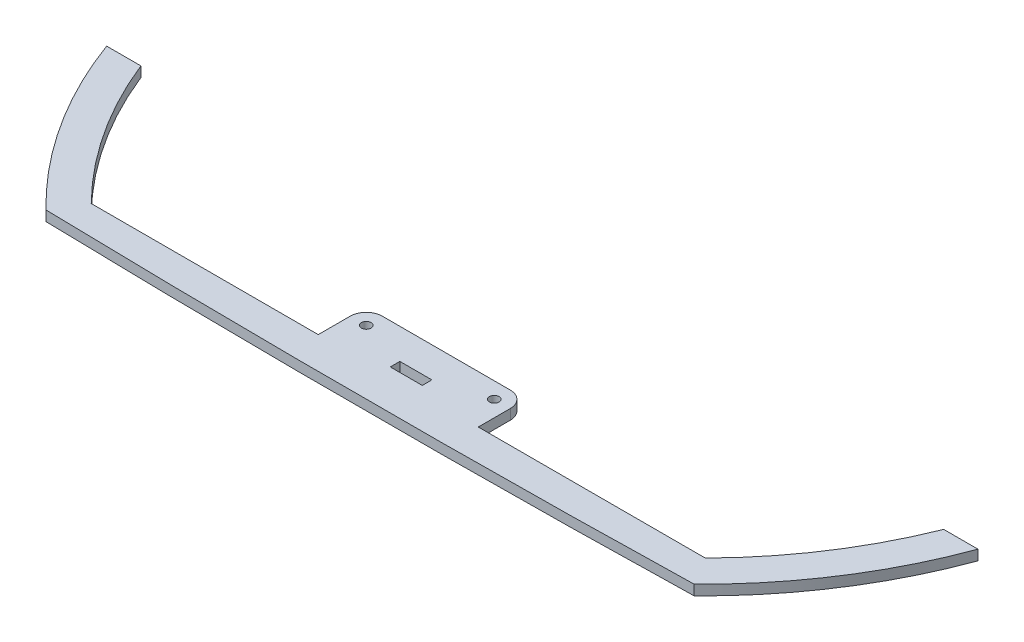
ISO-10303-21;
HEADER;
FILE_DESCRIPTION(('STEP AP214'),'2;1');
FILE_NAME('part.step','',(''),(''),'','','');
FILE_SCHEMA(('AUTOMOTIVE_DESIGN { 1 0 10303 214 1 1 1 1 }'));
ENDSEC;
DATA;
#1=APPLICATION_CONTEXT('core data for automotive mechanical design processes');
#2=APPLICATION_PROTOCOL_DEFINITION('international standard','automotive_design',2000,#1);
#3=PRODUCT_CONTEXT('',#1,'mechanical');
#4=PRODUCT('Part','Part','',(#3));
#5=PRODUCT_RELATED_PRODUCT_CATEGORY('part','',(#4));
#6=PRODUCT_DEFINITION_FORMATION('','',#4);
#7=PRODUCT_DEFINITION_CONTEXT('part definition',#1,'design');
#8=PRODUCT_DEFINITION('design','',#6,#7);
#9=PRODUCT_DEFINITION_SHAPE('','',#8);
#10=(LENGTH_UNIT() NAMED_UNIT(*) SI_UNIT(.MILLI.,.METRE.));
#11=(NAMED_UNIT(*) PLANE_ANGLE_UNIT() SI_UNIT($,.RADIAN.));
#12=(NAMED_UNIT(*) SI_UNIT($,.STERADIAN.) SOLID_ANGLE_UNIT());
#13=UNCERTAINTY_MEASURE_WITH_UNIT(LENGTH_MEASURE(1.E-05),#10,'distance_accuracy_value','');
#14=(GEOMETRIC_REPRESENTATION_CONTEXT(3) GLOBAL_UNCERTAINTY_ASSIGNED_CONTEXT((#13)) GLOBAL_UNIT_ASSIGNED_CONTEXT((#10,
#11,#12)) REPRESENTATION_CONTEXT('',''));
#15=CARTESIAN_POINT('',(0.,0.,0.));
#16=DIRECTION('',(0.,0.,1.));
#17=DIRECTION('',(1.,0.,0.));
#18=AXIS2_PLACEMENT_3D('',#15,#16,#17);
#19=CARTESIAN_POINT('',(0.,3.175,10.));
#20=DIRECTION('',(0.,1.,0.));
#21=DIRECTION('',(0.,0.,1.));
#22=AXIS2_PLACEMENT_3D('',#19,#20,#21);
#23=PLANE('',#22);
#24=CARTESIAN_POINT('',(-20.,3.175,0.));
#25=DIRECTION('',(0.,1.,0.));
#26=DIRECTION('',(0.,0.,1.));
#27=AXIS2_PLACEMENT_3D('',#24,#25,#26);
#28=CIRCLE('',#27,1.5);
#29=CARTESIAN_POINT('',(-20.,3.175,1.5));
#30=VERTEX_POINT('',#29);
#31=EDGE_CURVE('E227',#30,#30,#28,.T.);
#32=ORIENTED_EDGE('',*,*,#31,.F.);
#33=EDGE_LOOP('',(#32));
#34=FACE_BOUND('',#33,.T.);
#35=DIRECTION('',(-1.,0.,0.));
#36=VECTOR('',#35,1.);
#37=CARTESIAN_POINT('',(25.,3.175,10.));
#38=LINE('',#37,#36);
#39=CARTESIAN_POINT('',(95.9166304662544,3.175,9.99999999999999));
#40=VERTEX_POINT('',#39);
#41=CARTESIAN_POINT('',(25.,3.175,10.));
#42=VERTEX_POINT('',#41);
#43=EDGE_CURVE('E235',#40,#42,#38,.T.);
#44=ORIENTED_EDGE('',*,*,#43,.T.);
#45=DIRECTION('',(0.,0.,-1.));
#46=VECTOR('',#45,1.);
#47=CARTESIAN_POINT('',(25.,3.175,0.));
#48=LINE('',#47,#46);
#49=CARTESIAN_POINT('',(25.,3.175,0.));
#50=VERTEX_POINT('',#49);
#51=EDGE_CURVE('E239',#42,#50,#48,.T.);
#52=ORIENTED_EDGE('',*,*,#51,.T.);
#53=CARTESIAN_POINT('',(20.,3.175,0.));
#54=DIRECTION('',(0.,1.,0.));
#55=DIRECTION('',(0.,0.,-1.));
#56=AXIS2_PLACEMENT_3D('',#53,#54,#55);
#57=CIRCLE('',#56,5.);
#58=CARTESIAN_POINT('',(20.,3.175,-5.));
#59=VERTEX_POINT('',#58);
#60=EDGE_CURVE('E243',#50,#59,#57,.T.);
#61=ORIENTED_EDGE('',*,*,#60,.T.);
#62=DIRECTION('',(-1.,0.,0.));
#63=VECTOR('',#62,1.);
#64=CARTESIAN_POINT('',(-20.,3.175,-5.));
#65=LINE('',#64,#63);
#66=CARTESIAN_POINT('',(-20.,3.175,-5.));
#67=VERTEX_POINT('',#66);
#68=EDGE_CURVE('E246',#59,#67,#65,.T.);
#69=ORIENTED_EDGE('',*,*,#68,.T.);
#70=CARTESIAN_POINT('',(-20.,3.175,0.));
#71=DIRECTION('',(0.,1.,0.));
#72=DIRECTION('',(0.,0.,1.));
#73=AXIS2_PLACEMENT_3D('',#70,#71,#72);
#74=CIRCLE('',#73,5.);
#75=CARTESIAN_POINT('',(-25.,3.175,0.));
#76=VERTEX_POINT('',#75);
#77=EDGE_CURVE('E249',#67,#76,#74,.T.);
#78=ORIENTED_EDGE('',*,*,#77,.T.);
#79=DIRECTION('',(0.,0.,1.));
#80=VECTOR('',#79,1.);
#81=CARTESIAN_POINT('',(-25.,3.175,0.));
#82=LINE('',#81,#80);
#83=CARTESIAN_POINT('',(-25.,3.175,10.));
#84=VERTEX_POINT('',#83);
#85=EDGE_CURVE('E252',#76,#84,#82,.T.);
#86=ORIENTED_EDGE('',*,*,#85,.T.);
#87=DIRECTION('',(-1.,0.,0.));
#88=VECTOR('',#87,1.);
#89=CARTESIAN_POINT('',(-25.,3.175,10.));
#90=LINE('',#89,#88);
#91=CARTESIAN_POINT('',(-95.9166304662544,3.175,10.));
#92=VERTEX_POINT('',#91);
#93=EDGE_CURVE('E255',#84,#92,#90,.T.);
#94=ORIENTED_EDGE('',*,*,#93,.T.);
#95=CARTESIAN_POINT('',(0.,3.175,-85.));
#96=DIRECTION('',(0.,-1.,0.));
#97=DIRECTION('',(0.,0.,1.));
#98=AXIS2_PLACEMENT_3D('',#95,#96,#97);
#99=CIRCLE('',#98,135.);
#100=CARTESIAN_POINT('',(-125.399362039845,3.175,-35.0000000000001));
#101=VERTEX_POINT('',#100);
#102=EDGE_CURVE('E258',#92,#101,#99,.T.);
#103=ORIENTED_EDGE('',*,*,#102,.T.);
#104=DIRECTION('',(-1.,0.,0.));
#105=VECTOR('',#104,1.);
#106=CARTESIAN_POINT('',(-136.106575888162,3.175,-35.));
#107=LINE('',#106,#105);
#108=CARTESIAN_POINT('',(-136.106575888162,3.175,-35.));
#109=VERTEX_POINT('',#108);
#110=EDGE_CURVE('E261',#101,#109,#107,.T.);
#111=ORIENTED_EDGE('',*,*,#110,.T.);
#112=CARTESIAN_POINT('',(0.,3.175,-85.));
#113=DIRECTION('',(0.,1.,0.));
#114=DIRECTION('',(0.,0.,1.));
#115=AXIS2_PLACEMENT_3D('',#112,#113,#114);
#116=CIRCLE('',#115,145.);
#117=CARTESIAN_POINT('',(-101.248422592207,3.175,18.7967095942343));
#118=VERTEX_POINT('',#117);
#119=EDGE_CURVE('E264',#109,#118,#116,.T.);
#120=ORIENTED_EDGE('',*,*,#119,.T.);
#121=CARTESIAN_POINT('',(0.,3.175,10.));
#122=DIRECTION('',(0.,1.,0.));
#123=DIRECTION('',(-1.,0.,0.));
#124=AXIS2_PLACEMENT_3D('',#121,#122,#123);
#125=ELLIPSE('',#124,212.893363281403,10.);
#126=CARTESIAN_POINT('',(101.248422592207,3.175,18.7967095942342));
#127=VERTEX_POINT('',#126);
#128=EDGE_CURVE('E267',#118,#127,#125,.T.);
#129=ORIENTED_EDGE('',*,*,#128,.T.);
#130=CARTESIAN_POINT('',(0.,3.175,-85.));
#131=DIRECTION('',(0.,1.,0.));
#132=DIRECTION('',(0.,0.,1.));
#133=AXIS2_PLACEMENT_3D('',#130,#131,#132);
#134=CIRCLE('',#133,145.);
#135=CARTESIAN_POINT('',(136.106575888162,3.175,-35.));
#136=VERTEX_POINT('',#135);
#137=EDGE_CURVE('E271',#127,#136,#134,.T.);
#138=ORIENTED_EDGE('',*,*,#137,.T.);
#139=DIRECTION('',(-1.,0.,0.));
#140=VECTOR('',#139,1.);
#141=CARTESIAN_POINT('',(125.399362039845,3.175,-35.));
#142=LINE('',#141,#140);
#143=CARTESIAN_POINT('',(125.399362039845,3.175,-35.));
#144=VERTEX_POINT('',#143);
#145=EDGE_CURVE('E481',#136,#144,#142,.T.);
#146=ORIENTED_EDGE('',*,*,#145,.T.);
#147=CARTESIAN_POINT('',(0.,3.175,-85.));
#148=DIRECTION('',(0.,-1.,0.));
#149=DIRECTION('',(0.,0.,1.));
#150=AXIS2_PLACEMENT_3D('',#147,#148,#149);
#151=CIRCLE('',#150,135.);
#152=EDGE_CURVE('E362',#144,#40,#151,.T.);
#153=ORIENTED_EDGE('',*,*,#152,.T.);
#154=EDGE_LOOP('',(#44,#52,#61,#69,#78,#86,#94,#103,#111,#120,#129,#138,#146,#153));
#155=FACE_BOUND('',#154,.T.);
#156=CARTESIAN_POINT('',(20.,3.175,0.));
#157=DIRECTION('',(0.,1.,0.));
#158=DIRECTION('',(0.,0.,-1.));
#159=AXIS2_PLACEMENT_3D('',#156,#157,#158);
#160=CIRCLE('',#159,1.5);
#161=CARTESIAN_POINT('',(20.,3.175,-1.5));
#162=VERTEX_POINT('',#161);
#163=EDGE_CURVE('E219',#162,#162,#160,.T.);
#164=ORIENTED_EDGE('',*,*,#163,.F.);
#165=EDGE_LOOP('',(#164));
#166=FACE_BOUND('',#165,.T.);
#167=DIRECTION('',(-1.,0.,0.));
#168=VECTOR('',#167,1.);
#169=CARTESIAN_POINT('',(-5.,3.175,4.5));
#170=LINE('',#169,#168);
#171=CARTESIAN_POINT('',(5.,3.175,4.5));
#172=VERTEX_POINT('',#171);
#173=CARTESIAN_POINT('',(-5.,3.175,4.5));
#174=VERTEX_POINT('',#173);
#175=EDGE_CURVE('E180',#172,#174,#170,.T.);
#176=ORIENTED_EDGE('',*,*,#175,.F.);
#177=DIRECTION('',(0.,0.,-1.));
#178=VECTOR('',#177,1.);
#179=CARTESIAN_POINT('',(5.,3.175,4.5));
#180=LINE('',#179,#178);
#181=CARTESIAN_POINT('',(5.,3.175,7.5));
#182=VERTEX_POINT('',#181);
#183=EDGE_CURVE('E171',#182,#172,#180,.T.);
#184=ORIENTED_EDGE('',*,*,#183,.F.);
#185=DIRECTION('',(1.,0.,0.));
#186=VECTOR('',#185,1.);
#187=CARTESIAN_POINT('',(-5.,3.175,7.5));
#188=LINE('',#187,#186);
#189=CARTESIAN_POINT('',(-5.,3.175,7.5));
#190=VERTEX_POINT('',#189);
#191=EDGE_CURVE('E197',#190,#182,#188,.T.);
#192=ORIENTED_EDGE('',*,*,#191,.F.);
#193=DIRECTION('',(0.,0.,1.));
#194=VECTOR('',#193,1.);
#195=CARTESIAN_POINT('',(-5.,3.175,4.5));
#196=LINE('',#195,#194);
#197=EDGE_CURVE('E193',#174,#190,#196,.T.);
#198=ORIENTED_EDGE('',*,*,#197,.F.);
#199=EDGE_LOOP('',(#176,#184,#192,#198));
#200=FACE_BOUND('',#199,.T.);
#201=ADVANCED_FACE('F45',(#34,#155,#166,#200),#23,.T.);
#202=CARTESIAN_POINT('',(0.,0.,10.));
#203=DIRECTION('',(0.,1.,0.));
#204=DIRECTION('',(0.,0.,1.));
#205=AXIS2_PLACEMENT_3D('',#202,#203,#204);
#206=PLANE('',#205);
#207=CARTESIAN_POINT('',(20.,0.,0.));
#208=DIRECTION('',(0.,1.,0.));
#209=DIRECTION('',(0.,0.,-1.));
#210=AXIS2_PLACEMENT_3D('',#207,#208,#209);
#211=CIRCLE('',#210,1.5);
#212=CARTESIAN_POINT('',(20.,0.,-1.5));
#213=VERTEX_POINT('',#212);
#214=EDGE_CURVE('E189',#213,#213,#211,.T.);
#215=ORIENTED_EDGE('',*,*,#214,.T.);
#216=EDGE_LOOP('',(#215));
#217=FACE_BOUND('',#216,.T.);
#218=CARTESIAN_POINT('',(-20.,0.,0.));
#219=DIRECTION('',(0.,1.,0.));
#220=DIRECTION('',(0.,0.,1.));
#221=AXIS2_PLACEMENT_3D('',#218,#219,#220);
#222=CIRCLE('',#221,1.5);
#223=CARTESIAN_POINT('',(-20.,0.,1.5));
#224=VERTEX_POINT('',#223);
#225=EDGE_CURVE('E223',#224,#224,#222,.T.);
#226=ORIENTED_EDGE('',*,*,#225,.T.);
#227=EDGE_LOOP('',(#226));
#228=FACE_BOUND('',#227,.T.);
#229=DIRECTION('',(-1.,0.,0.));
#230=VECTOR('',#229,1.);
#231=CARTESIAN_POINT('',(25.,0.,10.));
#232=LINE('',#231,#230);
#233=CARTESIAN_POINT('',(95.9166304662544,0.,9.99999999999999));
#234=VERTEX_POINT('',#233);
#235=CARTESIAN_POINT('',(25.,0.,10.));
#236=VERTEX_POINT('',#235);
#237=EDGE_CURVE('E231',#234,#236,#232,.T.);
#238=ORIENTED_EDGE('',*,*,#237,.F.);
#239=CARTESIAN_POINT('',(0.,0.,-85.));
#240=DIRECTION('',(0.,-1.,0.));
#241=DIRECTION('',(0.,0.,1.));
#242=AXIS2_PLACEMENT_3D('',#239,#240,#241);
#243=CIRCLE('',#242,135.);
#244=CARTESIAN_POINT('',(125.399362039845,0.,-35.));
#245=VERTEX_POINT('',#244);
#246=EDGE_CURVE('E240',#245,#234,#243,.T.);
#247=ORIENTED_EDGE('',*,*,#246,.F.);
#248=DIRECTION('',(-1.,0.,0.));
#249=VECTOR('',#248,1.);
#250=CARTESIAN_POINT('',(125.399362039845,0.,-35.));
#251=LINE('',#250,#249);
#252=CARTESIAN_POINT('',(136.106575888162,0.,-35.));
#253=VERTEX_POINT('',#252);
#254=EDGE_CURVE('E347',#253,#245,#251,.T.);
#255=ORIENTED_EDGE('',*,*,#254,.F.);
#256=CARTESIAN_POINT('',(0.,0.,-85.));
#257=DIRECTION('',(0.,1.,0.));
#258=DIRECTION('',(0.,0.,1.));
#259=AXIS2_PLACEMENT_3D('',#256,#257,#258);
#260=CIRCLE('',#259,145.);
#261=CARTESIAN_POINT('',(101.248422592207,0.,18.7967095942342));
#262=VERTEX_POINT('',#261);
#263=EDGE_CURVE('E358',#262,#253,#260,.T.);
#264=ORIENTED_EDGE('',*,*,#263,.F.);
#265=CARTESIAN_POINT('',(0.,0.,10.));
#266=DIRECTION('',(0.,1.,0.));
#267=DIRECTION('',(-1.,0.,0.));
#268=AXIS2_PLACEMENT_3D('',#265,#266,#267);
#269=ELLIPSE('',#268,212.893363281403,10.);
#270=CARTESIAN_POINT('',(-101.248422592207,0.,18.7967095942343));
#271=VERTEX_POINT('',#270);
#272=EDGE_CURVE('E449',#271,#262,#269,.T.);
#273=ORIENTED_EDGE('',*,*,#272,.F.);
#274=CARTESIAN_POINT('',(0.,0.,-85.));
#275=DIRECTION('',(0.,1.,0.));
#276=DIRECTION('',(0.,0.,1.));
#277=AXIS2_PLACEMENT_3D('',#274,#275,#276);
#278=CIRCLE('',#277,145.);
#279=CARTESIAN_POINT('',(-136.106575888162,0.,-35.));
#280=VERTEX_POINT('',#279);
#281=EDGE_CURVE('E446',#280,#271,#278,.T.);
#282=ORIENTED_EDGE('',*,*,#281,.F.);
#283=DIRECTION('',(-1.,0.,0.));
#284=VECTOR('',#283,1.);
#285=CARTESIAN_POINT('',(-136.106575888162,0.,-35.));
#286=LINE('',#285,#284);
#287=CARTESIAN_POINT('',(-125.399362039845,0.,-35.0000000000001));
#288=VERTEX_POINT('',#287);
#289=EDGE_CURVE('E443',#288,#280,#286,.T.);
#290=ORIENTED_EDGE('',*,*,#289,.F.);
#291=CARTESIAN_POINT('',(0.,0.,-85.));
#292=DIRECTION('',(0.,-1.,0.));
#293=DIRECTION('',(0.,0.,1.));
#294=AXIS2_PLACEMENT_3D('',#291,#292,#293);
#295=CIRCLE('',#294,135.);
#296=CARTESIAN_POINT('',(-95.9166304662544,0.,10.));
#297=VERTEX_POINT('',#296);
#298=EDGE_CURVE('E440',#297,#288,#295,.T.);
#299=ORIENTED_EDGE('',*,*,#298,.F.);
#300=DIRECTION('',(-1.,0.,0.));
#301=VECTOR('',#300,1.);
#302=CARTESIAN_POINT('',(-25.,0.,10.));
#303=LINE('',#302,#301);
#304=CARTESIAN_POINT('',(-25.,0.,10.));
#305=VERTEX_POINT('',#304);
#306=EDGE_CURVE('E437',#305,#297,#303,.T.);
#307=ORIENTED_EDGE('',*,*,#306,.F.);
#308=DIRECTION('',(0.,0.,1.));
#309=VECTOR('',#308,1.);
#310=CARTESIAN_POINT('',(-25.,0.,0.));
#311=LINE('',#310,#309);
#312=CARTESIAN_POINT('',(-25.,0.,0.));
#313=VERTEX_POINT('',#312);
#314=EDGE_CURVE('E434',#313,#305,#311,.T.);
#315=ORIENTED_EDGE('',*,*,#314,.F.);
#316=CARTESIAN_POINT('',(-20.,0.,0.));
#317=DIRECTION('',(0.,1.,0.));
#318=DIRECTION('',(0.,0.,1.));
#319=AXIS2_PLACEMENT_3D('',#316,#317,#318);
#320=CIRCLE('',#319,5.);
#321=CARTESIAN_POINT('',(-20.,0.,-5.));
#322=VERTEX_POINT('',#321);
#323=EDGE_CURVE('E427',#322,#313,#320,.T.);
#324=ORIENTED_EDGE('',*,*,#323,.F.);
#325=DIRECTION('',(-1.,0.,0.));
#326=VECTOR('',#325,1.);
#327=CARTESIAN_POINT('',(-20.,0.,-5.));
#328=LINE('',#327,#326);
#329=CARTESIAN_POINT('',(20.,0.,-5.));
#330=VERTEX_POINT('',#329);
#331=EDGE_CURVE('E422',#330,#322,#328,.T.);
#332=ORIENTED_EDGE('',*,*,#331,.F.);
#333=CARTESIAN_POINT('',(20.,0.,0.));
#334=DIRECTION('',(0.,1.,0.));
#335=DIRECTION('',(0.,0.,-1.));
#336=AXIS2_PLACEMENT_3D('',#333,#334,#335);
#337=CIRCLE('',#336,5.);
#338=CARTESIAN_POINT('',(25.,0.,0.));
#339=VERTEX_POINT('',#338);
#340=EDGE_CURVE('E418',#339,#330,#337,.T.);
#341=ORIENTED_EDGE('',*,*,#340,.F.);
#342=DIRECTION('',(0.,0.,-1.));
#343=VECTOR('',#342,1.);
#344=CARTESIAN_POINT('',(25.,0.,0.));
#345=LINE('',#344,#343);
#346=EDGE_CURVE('E420',#236,#339,#345,.T.);
#347=ORIENTED_EDGE('',*,*,#346,.F.);
#348=EDGE_LOOP('',(#238,#247,#255,#264,#273,#282,#290,#299,#307,#315,#324,#332,#341,#347));
#349=FACE_BOUND('',#348,.T.);
#350=DIRECTION('',(0.,0.,-1.));
#351=VECTOR('',#350,1.);
#352=CARTESIAN_POINT('',(5.,0.,4.5));
#353=LINE('',#352,#351);
#354=CARTESIAN_POINT('',(5.,0.,7.5));
#355=VERTEX_POINT('',#354);
#356=CARTESIAN_POINT('',(5.,0.,4.5));
#357=VERTEX_POINT('',#356);
#358=EDGE_CURVE('E69',#355,#357,#353,.T.);
#359=ORIENTED_EDGE('',*,*,#358,.T.);
#360=DIRECTION('',(-1.,0.,0.));
#361=VECTOR('',#360,1.);
#362=CARTESIAN_POINT('',(-5.,0.,4.5));
#363=LINE('',#362,#361);
#364=CARTESIAN_POINT('',(-5.,0.,4.5));
#365=VERTEX_POINT('',#364);
#366=EDGE_CURVE('E187',#357,#365,#363,.T.);
#367=ORIENTED_EDGE('',*,*,#366,.T.);
#368=DIRECTION('',(0.,0.,1.));
#369=VECTOR('',#368,1.);
#370=CARTESIAN_POINT('',(-5.,0.,4.5));
#371=LINE('',#370,#369);
#372=CARTESIAN_POINT('',(-5.,0.,7.5));
#373=VERTEX_POINT('',#372);
#374=EDGE_CURVE('E206',#365,#373,#371,.T.);
#375=ORIENTED_EDGE('',*,*,#374,.T.);
#376=DIRECTION('',(1.,0.,0.));
#377=VECTOR('',#376,1.);
#378=CARTESIAN_POINT('',(-5.,0.,7.5));
#379=LINE('',#378,#377);
#380=EDGE_CURVE('E181',#373,#355,#379,.T.);
#381=ORIENTED_EDGE('',*,*,#380,.T.);
#382=EDGE_LOOP('',(#359,#367,#375,#381));
#383=FACE_BOUND('',#382,.T.);
#384=ADVANCED_FACE('F318',(#217,#228,#349,#383),#206,.F.);
#385=CARTESIAN_POINT('',(25.,3.175,10.));
#386=DIRECTION('',(0.,0.,1.));
#387=DIRECTION('',(1.,0.,0.));
#388=AXIS2_PLACEMENT_3D('',#385,#386,#387);
#389=PLANE('',#388);
#390=ORIENTED_EDGE('',*,*,#237,.T.);
#391=DIRECTION('',(0.,-1.,0.));
#392=VECTOR('',#391,1.);
#393=CARTESIAN_POINT('',(25.,3.175,10.));
#394=LINE('',#393,#392);
#395=EDGE_CURVE('E11',#42,#236,#394,.T.);
#396=ORIENTED_EDGE('',*,*,#395,.F.);
#397=ORIENTED_EDGE('',*,*,#43,.F.);
#398=DIRECTION('',(0.,-1.,0.));
#399=VECTOR('',#398,1.);
#400=CARTESIAN_POINT('',(95.9166304662544,3.175,9.99999999999999));
#401=LINE('',#400,#399);
#402=EDGE_CURVE('E364',#40,#234,#401,.T.);
#403=ORIENTED_EDGE('',*,*,#402,.T.);
#404=EDGE_LOOP('',(#390,#396,#397,#403));
#405=FACE_BOUND('',#404,.T.);
#406=ADVANCED_FACE('F47',(#405),#389,.F.);
#407=CARTESIAN_POINT('',(25.,3.175,0.));
#408=DIRECTION('',(-1.,0.,0.));
#409=DIRECTION('',(0.,0.,1.));
#410=AXIS2_PLACEMENT_3D('',#407,#408,#409);
#411=PLANE('',#410);
#412=ORIENTED_EDGE('',*,*,#346,.T.);
#413=DIRECTION('',(0.,-1.,0.));
#414=VECTOR('',#413,1.);
#415=CARTESIAN_POINT('',(25.,3.175,0.));
#416=LINE('',#415,#414);
#417=EDGE_CURVE('E54',#50,#339,#416,.T.);
#418=ORIENTED_EDGE('',*,*,#417,.F.);
#419=ORIENTED_EDGE('',*,*,#51,.F.);
#420=ORIENTED_EDGE('',*,*,#395,.T.);
#421=EDGE_LOOP('',(#412,#418,#419,#420));
#422=FACE_BOUND('',#421,.T.);
#423=ADVANCED_FACE('F311',(#422),#411,.F.);
#424=CARTESIAN_POINT('',(20.,3.175,0.));
#425=DIRECTION('',(0.,-1.,0.));
#426=DIRECTION('',(0.,0.,-1.));
#427=AXIS2_PLACEMENT_3D('',#424,#425,#426);
#428=CYLINDRICAL_SURFACE('',#427,5.);
#429=ORIENTED_EDGE('',*,*,#340,.T.);
#430=DIRECTION('',(0.,-1.,0.));
#431=VECTOR('',#430,1.);
#432=CARTESIAN_POINT('',(20.,3.175,-5.));
#433=LINE('',#432,#431);
#434=EDGE_CURVE('E409',#59,#330,#433,.T.);
#435=ORIENTED_EDGE('',*,*,#434,.F.);
#436=ORIENTED_EDGE('',*,*,#60,.F.);
#437=ORIENTED_EDGE('',*,*,#417,.T.);
#438=EDGE_LOOP('',(#429,#435,#436,#437));
#439=FACE_BOUND('',#438,.T.);
#440=ADVANCED_FACE('F308',(#439),#428,.T.);
#441=CARTESIAN_POINT('',(-20.,3.175,-5.));
#442=DIRECTION('',(0.,0.,1.));
#443=DIRECTION('',(1.,0.,0.));
#444=AXIS2_PLACEMENT_3D('',#441,#442,#443);
#445=PLANE('',#444);
#446=ORIENTED_EDGE('',*,*,#331,.T.);
#447=DIRECTION('',(0.,-1.,0.));
#448=VECTOR('',#447,1.);
#449=CARTESIAN_POINT('',(-20.,3.175,-5.));
#450=LINE('',#449,#448);
#451=EDGE_CURVE('E405',#67,#322,#450,.T.);
#452=ORIENTED_EDGE('',*,*,#451,.F.);
#453=ORIENTED_EDGE('',*,*,#68,.F.);
#454=ORIENTED_EDGE('',*,*,#434,.T.);
#455=EDGE_LOOP('',(#446,#452,#453,#454));
#456=FACE_BOUND('',#455,.T.);
#457=ADVANCED_FACE('F304',(#456),#445,.F.);
#458=CARTESIAN_POINT('',(-20.,3.175,0.));
#459=DIRECTION('',(0.,-1.,0.));
#460=DIRECTION('',(0.,0.,-1.));
#461=AXIS2_PLACEMENT_3D('',#458,#459,#460);
#462=CYLINDRICAL_SURFACE('',#461,5.);
#463=ORIENTED_EDGE('',*,*,#323,.T.);
#464=DIRECTION('',(0.,-1.,0.));
#465=VECTOR('',#464,1.);
#466=CARTESIAN_POINT('',(-25.,3.175,0.));
#467=LINE('',#466,#465);
#468=EDGE_CURVE('E401',#76,#313,#467,.T.);
#469=ORIENTED_EDGE('',*,*,#468,.F.);
#470=ORIENTED_EDGE('',*,*,#77,.F.);
#471=ORIENTED_EDGE('',*,*,#451,.T.);
#472=EDGE_LOOP('',(#463,#469,#470,#471));
#473=FACE_BOUND('',#472,.T.);
#474=ADVANCED_FACE('F300',(#473),#462,.T.);
#475=CARTESIAN_POINT('',(-25.,3.175,0.));
#476=DIRECTION('',(1.,0.,0.));
#477=DIRECTION('',(0.,0.,-1.));
#478=AXIS2_PLACEMENT_3D('',#475,#476,#477);
#479=PLANE('',#478);
#480=ORIENTED_EDGE('',*,*,#314,.T.);
#481=DIRECTION('',(0.,-1.,0.));
#482=VECTOR('',#481,1.);
#483=CARTESIAN_POINT('',(-25.,3.175,10.));
#484=LINE('',#483,#482);
#485=EDGE_CURVE('E397',#84,#305,#484,.T.);
#486=ORIENTED_EDGE('',*,*,#485,.F.);
#487=ORIENTED_EDGE('',*,*,#85,.F.);
#488=ORIENTED_EDGE('',*,*,#468,.T.);
#489=EDGE_LOOP('',(#480,#486,#487,#488));
#490=FACE_BOUND('',#489,.T.);
#491=ADVANCED_FACE('F296',(#490),#479,.F.);
#492=CARTESIAN_POINT('',(-25.,3.175,10.));
#493=DIRECTION('',(0.,0.,1.));
#494=DIRECTION('',(1.,0.,0.));
#495=AXIS2_PLACEMENT_3D('',#492,#493,#494);
#496=PLANE('',#495);
#497=ORIENTED_EDGE('',*,*,#306,.T.);
#498=DIRECTION('',(0.,-1.,0.));
#499=VECTOR('',#498,1.);
#500=CARTESIAN_POINT('',(-95.9166304662544,3.175,10.));
#501=LINE('',#500,#499);
#502=EDGE_CURVE('E393',#92,#297,#501,.T.);
#503=ORIENTED_EDGE('',*,*,#502,.F.);
#504=ORIENTED_EDGE('',*,*,#93,.F.);
#505=ORIENTED_EDGE('',*,*,#485,.T.);
#506=EDGE_LOOP('',(#497,#503,#504,#505));
#507=FACE_BOUND('',#506,.T.);
#508=ADVANCED_FACE('F292',(#507),#496,.F.);
#509=CARTESIAN_POINT('',(0.,3.175,-85.));
#510=DIRECTION('',(0.,-1.,0.));
#511=DIRECTION('',(0.,0.,-1.));
#512=AXIS2_PLACEMENT_3D('',#509,#510,#511);
#513=CYLINDRICAL_SURFACE('',#512,135.);
#514=ORIENTED_EDGE('',*,*,#298,.T.);
#515=DIRECTION('',(0.,-1.,0.));
#516=VECTOR('',#515,1.);
#517=CARTESIAN_POINT('',(-125.399362039845,3.175,-35.0000000000001));
#518=LINE('',#517,#516);
#519=EDGE_CURVE('E389',#101,#288,#518,.T.);
#520=ORIENTED_EDGE('',*,*,#519,.F.);
#521=ORIENTED_EDGE('',*,*,#102,.F.);
#522=ORIENTED_EDGE('',*,*,#502,.T.);
#523=EDGE_LOOP('',(#514,#520,#521,#522));
#524=FACE_BOUND('',#523,.T.);
#525=ADVANCED_FACE('F288',(#524),#513,.F.);
#526=CARTESIAN_POINT('',(-136.106575888162,3.175,-35.));
#527=DIRECTION('',(0.,0.,1.));
#528=DIRECTION('',(1.,0.,0.));
#529=AXIS2_PLACEMENT_3D('',#526,#527,#528);
#530=PLANE('',#529);
#531=ORIENTED_EDGE('',*,*,#289,.T.);
#532=DIRECTION('',(0.,-1.,0.));
#533=VECTOR('',#532,1.);
#534=CARTESIAN_POINT('',(-136.106575888162,3.175,-35.));
#535=LINE('',#534,#533);
#536=EDGE_CURVE('E385',#109,#280,#535,.T.);
#537=ORIENTED_EDGE('',*,*,#536,.F.);
#538=ORIENTED_EDGE('',*,*,#110,.F.);
#539=ORIENTED_EDGE('',*,*,#519,.T.);
#540=EDGE_LOOP('',(#531,#537,#538,#539));
#541=FACE_BOUND('',#540,.T.);
#542=ADVANCED_FACE('F284',(#541),#530,.F.);
#543=CARTESIAN_POINT('',(0.,3.175,-85.));
#544=DIRECTION('',(0.,-1.,0.));
#545=DIRECTION('',(0.,0.,-1.));
#546=AXIS2_PLACEMENT_3D('',#543,#544,#545);
#547=CYLINDRICAL_SURFACE('',#546,145.);
#548=ORIENTED_EDGE('',*,*,#281,.T.);
#549=DIRECTION('',(0.,-1.,0.));
#550=VECTOR('',#549,1.);
#551=CARTESIAN_POINT('',(-101.248422592207,3.175,18.7967095942343));
#552=LINE('',#551,#550);
#553=EDGE_CURVE('E381',#118,#271,#552,.T.);
#554=ORIENTED_EDGE('',*,*,#553,.F.);
#555=ORIENTED_EDGE('',*,*,#119,.F.);
#556=ORIENTED_EDGE('',*,*,#536,.T.);
#557=EDGE_LOOP('',(#548,#554,#555,#556));
#558=FACE_BOUND('',#557,.T.);
#559=ADVANCED_FACE('F279',(#558),#547,.T.);
#560=DIRECTION('',(0.,-1.,0.));
#561=VECTOR('',#560,1.);
#562=SURFACE_OF_LINEAR_EXTRUSION('',#125,#561);
#563=ORIENTED_EDGE('',*,*,#272,.T.);
#564=DIRECTION('',(0.,-1.,0.));
#565=VECTOR('',#564,1.);
#566=CARTESIAN_POINT('',(101.248422592207,3.175,18.7967095942342));
#567=LINE('',#566,#565);
#568=EDGE_CURVE('E377',#127,#262,#567,.T.);
#569=ORIENTED_EDGE('',*,*,#568,.F.);
#570=ORIENTED_EDGE('',*,*,#128,.F.);
#571=ORIENTED_EDGE('',*,*,#553,.T.);
#572=EDGE_LOOP('',(#563,#569,#570,#571));
#573=FACE_BOUND('',#572,.T.);
#574=ADVANCED_FACE('F274',(#573),#562,.F.);
#575=CARTESIAN_POINT('',(0.,3.175,-85.));
#576=DIRECTION('',(0.,-1.,0.));
#577=DIRECTION('',(0.,0.,-1.));
#578=AXIS2_PLACEMENT_3D('',#575,#576,#577);
#579=CYLINDRICAL_SURFACE('',#578,145.);
#580=ORIENTED_EDGE('',*,*,#263,.T.);
#581=DIRECTION('',(0.,-1.,0.));
#582=VECTOR('',#581,1.);
#583=CARTESIAN_POINT('',(136.106575888162,3.175,-35.));
#584=LINE('',#583,#582);
#585=EDGE_CURVE('E353',#136,#253,#584,.T.);
#586=ORIENTED_EDGE('',*,*,#585,.F.);
#587=ORIENTED_EDGE('',*,*,#137,.F.);
#588=ORIENTED_EDGE('',*,*,#568,.T.);
#589=EDGE_LOOP('',(#580,#586,#587,#588));
#590=FACE_BOUND('',#589,.T.);
#591=ADVANCED_FACE('F278',(#590),#579,.T.);
#592=CARTESIAN_POINT('',(125.399362039845,3.175,-35.));
#593=DIRECTION('',(0.,0.,1.));
#594=DIRECTION('',(1.,0.,0.));
#595=AXIS2_PLACEMENT_3D('',#592,#593,#594);
#596=PLANE('',#595);
#597=ORIENTED_EDGE('',*,*,#254,.T.);
#598=DIRECTION('',(0.,-1.,0.));
#599=VECTOR('',#598,1.);
#600=CARTESIAN_POINT('',(125.399362039845,3.175,-35.));
#601=LINE('',#600,#599);
#602=EDGE_CURVE('E350',#144,#245,#601,.T.);
#603=ORIENTED_EDGE('',*,*,#602,.F.);
#604=ORIENTED_EDGE('',*,*,#145,.F.);
#605=ORIENTED_EDGE('',*,*,#585,.T.);
#606=EDGE_LOOP('',(#597,#603,#604,#605));
#607=FACE_BOUND('',#606,.T.);
#608=ADVANCED_FACE('F336',(#607),#596,.F.);
#609=CARTESIAN_POINT('',(0.,3.175,-85.));
#610=DIRECTION('',(0.,-1.,0.));
#611=DIRECTION('',(0.,0.,-1.));
#612=AXIS2_PLACEMENT_3D('',#609,#610,#611);
#613=CYLINDRICAL_SURFACE('',#612,135.);
#614=ORIENTED_EDGE('',*,*,#246,.T.);
#615=ORIENTED_EDGE('',*,*,#402,.F.);
#616=ORIENTED_EDGE('',*,*,#152,.F.);
#617=ORIENTED_EDGE('',*,*,#602,.T.);
#618=EDGE_LOOP('',(#614,#615,#616,#617));
#619=FACE_BOUND('',#618,.T.);
#620=ADVANCED_FACE('F334',(#619),#613,.F.);
#621=CARTESIAN_POINT('',(-20.,3.175,0.));
#622=DIRECTION('',(0.,-1.,0.));
#623=DIRECTION('',(0.,0.,-1.));
#624=AXIS2_PLACEMENT_3D('',#621,#622,#623);
#625=CYLINDRICAL_SURFACE('',#624,1.5);
#626=ORIENTED_EDGE('',*,*,#31,.T.);
#627=EDGE_LOOP('',(#626));
#628=FACE_BOUND('',#627,.T.);
#629=ORIENTED_EDGE('',*,*,#225,.F.);
#630=EDGE_LOOP('',(#629));
#631=FACE_BOUND('',#630,.T.);
#632=ADVANCED_FACE('F331',(#628,#631),#625,.F.);
#633=CARTESIAN_POINT('',(20.,3.175,0.));
#634=DIRECTION('',(0.,-1.,0.));
#635=DIRECTION('',(0.,0.,-1.));
#636=AXIS2_PLACEMENT_3D('',#633,#634,#635);
#637=CYLINDRICAL_SURFACE('',#636,1.5);
#638=ORIENTED_EDGE('',*,*,#163,.T.);
#639=EDGE_LOOP('',(#638));
#640=FACE_BOUND('',#639,.T.);
#641=ORIENTED_EDGE('',*,*,#214,.F.);
#642=EDGE_LOOP('',(#641));
#643=FACE_BOUND('',#642,.T.);
#644=ADVANCED_FACE('F486',(#640,#643),#637,.F.);
#645=CARTESIAN_POINT('',(5.,3.175,4.5));
#646=DIRECTION('',(-1.,0.,0.));
#647=DIRECTION('',(0.,0.,1.));
#648=AXIS2_PLACEMENT_3D('',#645,#646,#647);
#649=PLANE('',#648);
#650=ORIENTED_EDGE('',*,*,#358,.F.);
#651=DIRECTION('',(0.,-1.,0.));
#652=VECTOR('',#651,1.);
#653=CARTESIAN_POINT('',(5.,3.175,7.5));
#654=LINE('',#653,#652);
#655=EDGE_CURVE('E175',#182,#355,#654,.T.);
#656=ORIENTED_EDGE('',*,*,#655,.F.);
#657=ORIENTED_EDGE('',*,*,#183,.T.);
#658=DIRECTION('',(0.,-1.,0.));
#659=VECTOR('',#658,1.);
#660=CARTESIAN_POINT('',(5.,3.175,4.5));
#661=LINE('',#660,#659);
#662=EDGE_CURVE('E174',#172,#357,#661,.T.);
#663=ORIENTED_EDGE('',*,*,#662,.T.);
#664=EDGE_LOOP('',(#650,#656,#657,#663));
#665=FACE_BOUND('',#664,.T.);
#666=ADVANCED_FACE('F173',(#665),#649,.T.);
#667=CARTESIAN_POINT('',(-5.,3.175,4.5));
#668=DIRECTION('',(0.,0.,1.));
#669=DIRECTION('',(1.,0.,0.));
#670=AXIS2_PLACEMENT_3D('',#667,#668,#669);
#671=PLANE('',#670);
#672=ORIENTED_EDGE('',*,*,#366,.F.);
#673=ORIENTED_EDGE('',*,*,#662,.F.);
#674=ORIENTED_EDGE('',*,*,#175,.T.);
#675=DIRECTION('',(0.,-1.,0.));
#676=VECTOR('',#675,1.);
#677=CARTESIAN_POINT('',(-5.,3.175,4.5));
#678=LINE('',#677,#676);
#679=EDGE_CURVE('E190',#174,#365,#678,.T.);
#680=ORIENTED_EDGE('',*,*,#679,.T.);
#681=EDGE_LOOP('',(#672,#673,#674,#680));
#682=FACE_BOUND('',#681,.T.);
#683=ADVANCED_FACE('F184',(#682),#671,.T.);
#684=CARTESIAN_POINT('',(-5.,3.175,4.5));
#685=DIRECTION('',(1.,0.,0.));
#686=DIRECTION('',(0.,0.,-1.));
#687=AXIS2_PLACEMENT_3D('',#684,#685,#686);
#688=PLANE('',#687);
#689=ORIENTED_EDGE('',*,*,#374,.F.);
#690=ORIENTED_EDGE('',*,*,#679,.F.);
#691=ORIENTED_EDGE('',*,*,#197,.T.);
#692=DIRECTION('',(0.,-1.,0.));
#693=VECTOR('',#692,1.);
#694=CARTESIAN_POINT('',(-5.,3.175,7.5));
#695=LINE('',#694,#693);
#696=EDGE_CURVE('E61',#190,#373,#695,.T.);
#697=ORIENTED_EDGE('',*,*,#696,.T.);
#698=EDGE_LOOP('',(#689,#690,#691,#697));
#699=FACE_BOUND('',#698,.T.);
#700=ADVANCED_FACE('F518',(#699),#688,.T.);
#701=CARTESIAN_POINT('',(-5.,3.175,7.5));
#702=DIRECTION('',(0.,0.,-1.));
#703=DIRECTION('',(-1.,0.,0.));
#704=AXIS2_PLACEMENT_3D('',#701,#702,#703);
#705=PLANE('',#704);
#706=ORIENTED_EDGE('',*,*,#380,.F.);
#707=ORIENTED_EDGE('',*,*,#696,.F.);
#708=ORIENTED_EDGE('',*,*,#191,.T.);
#709=ORIENTED_EDGE('',*,*,#655,.T.);
#710=EDGE_LOOP('',(#706,#707,#708,#709));
#711=FACE_BOUND('',#710,.T.);
#712=ADVANCED_FACE('F526',(#711),#705,.T.);
#713=CLOSED_SHELL('',(#201,#384,#406,#423,#440,#457,#474,#491,#508,#525,#542,#559,#574,#591,
#608,#620,#632,#644,#666,#683,#700,#712));
#714=MANIFOLD_SOLID_BREP('B2',#713);
#715=ADVANCED_BREP_SHAPE_REPRESENTATION('',(#18,#714),#14);
#716=SHAPE_DEFINITION_REPRESENTATION(#9,#715);
ENDSEC;
END-ISO-10303-21;
